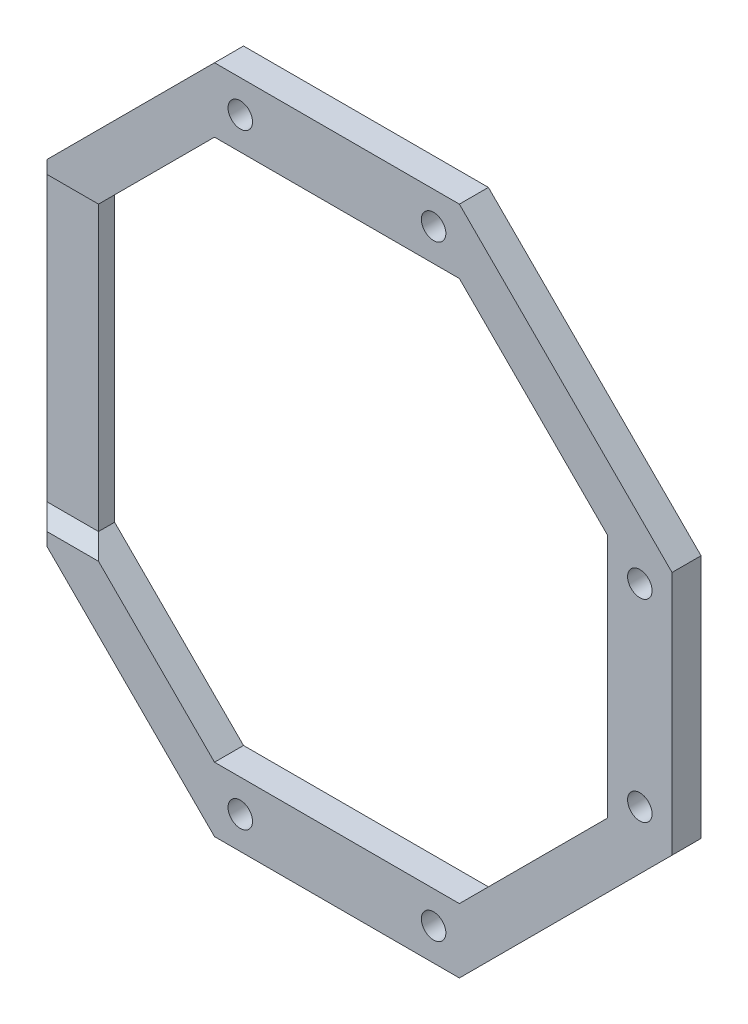
ISO-10303-21;
HEADER;
FILE_DESCRIPTION(('STEP AP214'),'2;1');
FILE_NAME('part.step','',(''),(''),'','','');
FILE_SCHEMA(('AUTOMOTIVE_DESIGN { 1 0 10303 214 1 1 1 1 }'));
ENDSEC;
DATA;
#1=APPLICATION_CONTEXT('core data for automotive mechanical design processes');
#2=APPLICATION_PROTOCOL_DEFINITION('international standard','automotive_design',2000,#1);
#3=PRODUCT_CONTEXT('',#1,'mechanical');
#4=PRODUCT('Part','Part','',(#3));
#5=PRODUCT_RELATED_PRODUCT_CATEGORY('part','',(#4));
#6=PRODUCT_DEFINITION_FORMATION('','',#4);
#7=PRODUCT_DEFINITION_CONTEXT('part definition',#1,'design');
#8=PRODUCT_DEFINITION('design','',#6,#7);
#9=PRODUCT_DEFINITION_SHAPE('','',#8);
#10=(LENGTH_UNIT() NAMED_UNIT(*) SI_UNIT(.MILLI.,.METRE.));
#11=(NAMED_UNIT(*) PLANE_ANGLE_UNIT() SI_UNIT($,.RADIAN.));
#12=(NAMED_UNIT(*) SI_UNIT($,.STERADIAN.) SOLID_ANGLE_UNIT());
#13=UNCERTAINTY_MEASURE_WITH_UNIT(LENGTH_MEASURE(1.E-05),#10,'distance_accuracy_value','');
#14=(GEOMETRIC_REPRESENTATION_CONTEXT(3) GLOBAL_UNCERTAINTY_ASSIGNED_CONTEXT((#13)) GLOBAL_UNIT_ASSIGNED_CONTEXT((#10,
#11,#12)) REPRESENTATION_CONTEXT('',''));
#15=CARTESIAN_POINT('',(0.,0.,0.));
#16=DIRECTION('',(0.,0.,1.));
#17=DIRECTION('',(1.,0.,0.));
#18=AXIS2_PLACEMENT_3D('',#15,#16,#17);
#19=CARTESIAN_POINT('',(64.488658439,-84.505114056,-63.2));
#20=DIRECTION('',(-0.707106781186548,-0.707106781186548,0.));
#21=DIRECTION('',(-0.707106781186548,0.707106781186548,0.));
#22=AXIS2_PLACEMENT_3D('',#19,#20,#21);
#23=PLANE('',#22);
#24=DIRECTION('',(-0.707106781186548,0.707106781186548,0.));
#25=VECTOR('',#24,1.);
#26=CARTESIAN_POINT('',(80.988658439,-101.005114056,-63.2));
#27=LINE('',#26,#25);
#28=CARTESIAN_POINT('',(80.988658439,-101.005114056,-63.2));
#29=VERTEX_POINT('',#28);
#30=CARTESIAN_POINT('',(54.988658439,-75.005114056,-63.2));
#31=VERTEX_POINT('',#30);
#32=EDGE_CURVE('E11',#29,#31,#27,.T.);
#33=ORIENTED_EDGE('',*,*,#32,.T.);
#34=DIRECTION('',(-0.577350269189626,0.577350269189626,-0.577350269189626));
#35=VECTOR('',#34,1.);
#36=CARTESIAN_POINT('',(54.988658439,-75.005114056,-63.2));
#37=LINE('',#36,#35);
#38=CARTESIAN_POINT('',(50.488658439,-70.505114056,-67.7));
#39=VERTEX_POINT('',#38);
#40=EDGE_CURVE('E47',#31,#39,#37,.T.);
#41=ORIENTED_EDGE('',*,*,#40,.T.);
#42=DIRECTION('',(-0.707106781186548,0.707106781186548,0.));
#43=VECTOR('',#42,1.);
#44=CARTESIAN_POINT('',(80.988658439,-101.005114056,-67.7));
#45=LINE('',#44,#43);
#46=CARTESIAN_POINT('',(80.988658439,-101.005114056,-67.7));
#47=VERTEX_POINT('',#46);
#48=EDGE_CURVE('E62',#47,#39,#45,.T.);
#49=ORIENTED_EDGE('',*,*,#48,.F.);
#50=DIRECTION('',(0.,0.,-1.));
#51=VECTOR('',#50,1.);
#52=CARTESIAN_POINT('',(80.988658439,-101.005114056,-63.2));
#53=LINE('',#52,#51);
#54=EDGE_CURVE('E303',#29,#47,#53,.T.);
#55=ORIENTED_EDGE('',*,*,#54,.F.);
#56=EDGE_LOOP('',(#33,#41,#49,#55));
#57=FACE_BOUND('',#56,.T.);
#58=ADVANCED_FACE('F38',(#57),#23,.T.);
#59=CARTESIAN_POINT('',(90.488658439,-101.005114056,-63.2));
#60=DIRECTION('',(0.,1.,0.));
#61=DIRECTION('',(1.,0.,0.));
#62=AXIS2_PLACEMENT_3D('',#59,#60,#61);
#63=PLANE('',#62);
#64=DIRECTION('',(1.,0.,0.));
#65=VECTOR('',#64,1.);
#66=CARTESIAN_POINT('',(80.988658439,-101.005114056,-67.7));
#67=LINE('',#66,#65);
#68=CARTESIAN_POINT('',(118.988658439,-101.005114056,-67.7));
#69=VERTEX_POINT('',#68);
#70=EDGE_CURVE('E408',#47,#69,#67,.T.);
#71=ORIENTED_EDGE('',*,*,#70,.T.);
#72=DIRECTION('',(0.,0.,-1.));
#73=VECTOR('',#72,1.);
#74=CARTESIAN_POINT('',(118.988658439,-101.005114056,-63.2));
#75=LINE('',#74,#73);
#76=CARTESIAN_POINT('',(118.988658439,-101.005114056,-63.2));
#77=VERTEX_POINT('',#76);
#78=EDGE_CURVE('E281',#77,#69,#75,.T.);
#79=ORIENTED_EDGE('',*,*,#78,.F.);
#80=DIRECTION('',(1.,0.,0.));
#81=VECTOR('',#80,1.);
#82=CARTESIAN_POINT('',(80.988658439,-101.005114056,-63.2));
#83=LINE('',#82,#81);
#84=EDGE_CURVE('E398',#29,#77,#83,.T.);
#85=ORIENTED_EDGE('',*,*,#84,.F.);
#86=ORIENTED_EDGE('',*,*,#54,.T.);
#87=EDGE_LOOP('',(#71,#79,#85,#86));
#88=FACE_BOUND('',#87,.T.);
#89=ADVANCED_FACE('F524',(#88),#63,.F.);
#90=CARTESIAN_POINT('',(135.488658439,-84.505114056,-63.2));
#91=DIRECTION('',(-0.707106781186548,0.707106781186548,0.));
#92=DIRECTION('',(0.,0.,1.));
#93=AXIS2_PLACEMENT_3D('',#90,#91,#92);
#94=PLANE('',#93);
#95=DIRECTION('',(0.707106781186548,0.707106781186548,0.));
#96=VECTOR('',#95,1.);
#97=CARTESIAN_POINT('',(118.988658439,-101.005114056,-67.7));
#98=LINE('',#97,#96);
#99=CARTESIAN_POINT('',(151.988658439,-68.005114056,-67.7));
#100=VERTEX_POINT('',#99);
#101=EDGE_CURVE('E283',#69,#100,#98,.T.);
#102=ORIENTED_EDGE('',*,*,#101,.T.);
#103=DIRECTION('',(0.,0.,-1.));
#104=VECTOR('',#103,1.);
#105=CARTESIAN_POINT('',(151.988658439,-68.005114056,-63.2));
#106=LINE('',#105,#104);
#107=CARTESIAN_POINT('',(151.988658439,-68.005114056,-63.2));
#108=VERTEX_POINT('',#107);
#109=EDGE_CURVE('E318',#108,#100,#106,.T.);
#110=ORIENTED_EDGE('',*,*,#109,.F.);
#111=DIRECTION('',(0.707106781186548,0.707106781186548,0.));
#112=VECTOR('',#111,1.);
#113=CARTESIAN_POINT('',(118.988658439,-101.005114056,-63.2));
#114=LINE('',#113,#112);
#115=EDGE_CURVE('E400',#77,#108,#114,.T.);
#116=ORIENTED_EDGE('',*,*,#115,.F.);
#117=ORIENTED_EDGE('',*,*,#78,.T.);
#118=EDGE_LOOP('',(#102,#110,#116,#117));
#119=FACE_BOUND('',#118,.T.);
#120=ADVANCED_FACE('F530',(#119),#94,.F.);
#121=CARTESIAN_POINT('',(151.988658439,-49.005114056,-63.2));
#122=DIRECTION('',(1.,0.,0.));
#123=DIRECTION('',(0.,1.,0.));
#124=AXIS2_PLACEMENT_3D('',#121,#122,#123);
#125=PLANE('',#124);
#126=DIRECTION('',(0.,-1.,0.));
#127=VECTOR('',#126,1.);
#128=CARTESIAN_POINT('',(151.988658439,-30.005114056,-67.7));
#129=LINE('',#128,#127);
#130=CARTESIAN_POINT('',(151.988658439,-30.005114056,-67.7));
#131=VERTEX_POINT('',#130);
#132=EDGE_CURVE('E299',#131,#100,#129,.T.);
#133=ORIENTED_EDGE('',*,*,#132,.F.);
#134=DIRECTION('',(0.,0.,-1.));
#135=VECTOR('',#134,1.);
#136=CARTESIAN_POINT('',(151.988658439,-30.005114056,-63.2));
#137=LINE('',#136,#135);
#138=CARTESIAN_POINT('',(151.988658439,-30.005114056,-63.2));
#139=VERTEX_POINT('',#138);
#140=EDGE_CURVE('E411',#139,#131,#137,.T.);
#141=ORIENTED_EDGE('',*,*,#140,.F.);
#142=DIRECTION('',(0.,-1.,0.));
#143=VECTOR('',#142,1.);
#144=CARTESIAN_POINT('',(151.988658439,-30.005114056,-63.2));
#145=LINE('',#144,#143);
#146=EDGE_CURVE('E284',#139,#108,#145,.T.);
#147=ORIENTED_EDGE('',*,*,#146,.T.);
#148=ORIENTED_EDGE('',*,*,#109,.T.);
#149=EDGE_LOOP('',(#133,#141,#147,#148));
#150=FACE_BOUND('',#149,.T.);
#151=ADVANCED_FACE('F40',(#150),#125,.T.);
#152=CARTESIAN_POINT('',(135.488658439,-13.505114056,-63.2));
#153=DIRECTION('',(-0.707106781186548,-0.707106781186548,0.));
#154=DIRECTION('',(-0.707106781186548,0.707106781186548,0.));
#155=AXIS2_PLACEMENT_3D('',#152,#153,#154);
#156=PLANE('',#155);
#157=DIRECTION('',(-0.707106781186548,0.707106781186548,0.));
#158=VECTOR('',#157,1.);
#159=CARTESIAN_POINT('',(151.988658439,-30.005114056,-67.7));
#160=LINE('',#159,#158);
#161=CARTESIAN_POINT('',(118.988658439,2.994885944,-67.7));
#162=VERTEX_POINT('',#161);
#163=EDGE_CURVE('E320',#131,#162,#160,.T.);
#164=ORIENTED_EDGE('',*,*,#163,.T.);
#165=DIRECTION('',(0.,0.,-1.));
#166=VECTOR('',#165,1.);
#167=CARTESIAN_POINT('',(118.988658439,2.994885944,-63.2));
#168=LINE('',#167,#166);
#169=CARTESIAN_POINT('',(118.988658439,2.994885944,-63.2));
#170=VERTEX_POINT('',#169);
#171=EDGE_CURVE('E177',#170,#162,#168,.T.);
#172=ORIENTED_EDGE('',*,*,#171,.F.);
#173=DIRECTION('',(-0.707106781186548,0.707106781186548,0.));
#174=VECTOR('',#173,1.);
#175=CARTESIAN_POINT('',(151.988658439,-30.005114056,-63.2));
#176=LINE('',#175,#174);
#177=EDGE_CURVE('E170',#139,#170,#176,.T.);
#178=ORIENTED_EDGE('',*,*,#177,.F.);
#179=ORIENTED_EDGE('',*,*,#140,.T.);
#180=EDGE_LOOP('',(#164,#172,#178,#179));
#181=FACE_BOUND('',#180,.T.);
#182=ADVANCED_FACE('F533',(#181),#156,.F.);
#183=CARTESIAN_POINT('',(109.488658439,2.994885944,-63.2));
#184=DIRECTION('',(0.,-1.,0.));
#185=DIRECTION('',(0.,0.,-1.));
#186=AXIS2_PLACEMENT_3D('',#183,#184,#185);
#187=PLANE('',#186);
#188=DIRECTION('',(-1.,0.,0.));
#189=VECTOR('',#188,1.);
#190=CARTESIAN_POINT('',(118.988658439,2.994885944,-67.7));
#191=LINE('',#190,#189);
#192=CARTESIAN_POINT('',(80.988658439,2.994885944,-67.7));
#193=VERTEX_POINT('',#192);
#194=EDGE_CURVE('E414',#162,#193,#191,.T.);
#195=ORIENTED_EDGE('',*,*,#194,.T.);
#196=DIRECTION('',(0.,0.,-1.));
#197=VECTOR('',#196,1.);
#198=CARTESIAN_POINT('',(80.988658439,2.994885944,-63.2));
#199=LINE('',#198,#197);
#200=CARTESIAN_POINT('',(80.988658439,2.994885944,-63.2));
#201=VERTEX_POINT('',#200);
#202=EDGE_CURVE('E314',#201,#193,#199,.T.);
#203=ORIENTED_EDGE('',*,*,#202,.F.);
#204=DIRECTION('',(-1.,0.,0.));
#205=VECTOR('',#204,1.);
#206=CARTESIAN_POINT('',(118.988658439,2.994885944,-63.2));
#207=LINE('',#206,#205);
#208=EDGE_CURVE('E345',#170,#201,#207,.T.);
#209=ORIENTED_EDGE('',*,*,#208,.F.);
#210=ORIENTED_EDGE('',*,*,#171,.T.);
#211=EDGE_LOOP('',(#195,#203,#209,#210));
#212=FACE_BOUND('',#211,.T.);
#213=ADVANCED_FACE('F553',(#212),#187,.F.);
#214=CARTESIAN_POINT('',(64.488658439,-13.505114056,-63.2));
#215=DIRECTION('',(-0.707106781186548,0.707106781186548,0.));
#216=DIRECTION('',(0.,0.,1.));
#217=AXIS2_PLACEMENT_3D('',#214,#215,#216);
#218=PLANE('',#217);
#219=DIRECTION('',(0.707106781186548,0.707106781186548,0.));
#220=VECTOR('',#219,1.);
#221=CARTESIAN_POINT('',(50.488658439,-27.505114056,-67.7));
#222=LINE('',#221,#220);
#223=CARTESIAN_POINT('',(50.488658439,-27.505114056,-67.7));
#224=VERTEX_POINT('',#223);
#225=EDGE_CURVE('E359',#224,#193,#222,.T.);
#226=ORIENTED_EDGE('',*,*,#225,.F.);
#227=DIRECTION('',(0.577350269189626,0.577350269189626,0.577350269189626));
#228=VECTOR('',#227,1.);
#229=CARTESIAN_POINT('',(50.488658439,-27.505114056,-67.7));
#230=LINE('',#229,#228);
#231=CARTESIAN_POINT('',(54.988658439,-23.005114056,-63.2));
#232=VERTEX_POINT('',#231);
#233=EDGE_CURVE('E277',#224,#232,#230,.T.);
#234=ORIENTED_EDGE('',*,*,#233,.T.);
#235=DIRECTION('',(0.707106781186548,0.707106781186548,0.));
#236=VECTOR('',#235,1.);
#237=CARTESIAN_POINT('',(54.988658439,-23.005114056,-63.2));
#238=LINE('',#237,#236);
#239=EDGE_CURVE('E280',#232,#201,#238,.T.);
#240=ORIENTED_EDGE('',*,*,#239,.T.);
#241=ORIENTED_EDGE('',*,*,#202,.T.);
#242=EDGE_LOOP('',(#226,#234,#240,#241));
#243=FACE_BOUND('',#242,.T.);
#244=ADVANCED_FACE('F549',(#243),#218,.T.);
#245=CARTESIAN_POINT('',(70.988658439,-17.005114056,-63.2));
#246=DIRECTION('',(0.707106781186548,-0.707106781186548,0.));
#247=DIRECTION('',(0.,0.,-1.));
#248=AXIS2_PLACEMENT_3D('',#245,#246,#247);
#249=PLANE('',#248);
#250=DIRECTION('',(-0.707106781186548,-0.707106781186548,0.));
#251=VECTOR('',#250,1.);
#252=CARTESIAN_POINT('',(80.988658439,-7.005114056,-63.2));
#253=LINE('',#252,#251);
#254=CARTESIAN_POINT('',(80.988658439,-7.005114056,-63.2));
#255=VERTEX_POINT('',#254);
#256=CARTESIAN_POINT('',(62.988658439,-25.005114056,-63.2));
#257=VERTEX_POINT('',#256);
#258=EDGE_CURVE('E478',#255,#257,#253,.T.);
#259=ORIENTED_EDGE('',*,*,#258,.T.);
#260=DIRECTION('',(-0.577350269189626,-0.577350269189626,-0.577350269189626));
#261=VECTOR('',#260,1.);
#262=CARTESIAN_POINT('',(62.988658439,-25.005114056,-63.2));
#263=LINE('',#262,#261);
#264=CARTESIAN_POINT('',(60.988658439,-27.005114056,-65.2));
#265=VERTEX_POINT('',#264);
#266=EDGE_CURVE('E324',#257,#265,#263,.T.);
#267=ORIENTED_EDGE('',*,*,#266,.T.);
#268=DIRECTION('',(0.,0.,-1.));
#269=VECTOR('',#268,1.);
#270=CARTESIAN_POINT('',(60.988658439,-27.005114056,-65.2));
#271=LINE('',#270,#269);
#272=CARTESIAN_POINT('',(60.988658439,-27.005114056,-67.7));
#273=VERTEX_POINT('',#272);
#274=EDGE_CURVE('E321',#265,#273,#271,.T.);
#275=ORIENTED_EDGE('',*,*,#274,.T.);
#276=DIRECTION('',(-0.707106781186548,-0.707106781186548,0.));
#277=VECTOR('',#276,1.);
#278=CARTESIAN_POINT('',(80.988658439,-7.005114056,-67.7));
#279=LINE('',#278,#277);
#280=CARTESIAN_POINT('',(80.988658439,-7.005114056,-67.7));
#281=VERTEX_POINT('',#280);
#282=EDGE_CURVE('E300',#281,#273,#279,.T.);
#283=ORIENTED_EDGE('',*,*,#282,.F.);
#284=DIRECTION('',(0.,0.,-1.));
#285=VECTOR('',#284,1.);
#286=CARTESIAN_POINT('',(80.988658439,-7.005114056,-63.2));
#287=LINE('',#286,#285);
#288=EDGE_CURVE('E388',#255,#281,#287,.T.);
#289=ORIENTED_EDGE('',*,*,#288,.F.);
#290=EDGE_LOOP('',(#259,#267,#275,#283,#289));
#291=FACE_BOUND('',#290,.T.);
#292=ADVANCED_FACE('F552',(#291),#249,.T.);
#293=CARTESIAN_POINT('',(99.988658439,-7.005114056,-63.2));
#294=DIRECTION('',(0.,1.,0.));
#295=DIRECTION('',(1.,0.,0.));
#296=AXIS2_PLACEMENT_3D('',#293,#294,#295);
#297=PLANE('',#296);
#298=DIRECTION('',(1.,0.,0.));
#299=VECTOR('',#298,1.);
#300=CARTESIAN_POINT('',(80.988658439,-7.005114056,-67.7));
#301=LINE('',#300,#299);
#302=CARTESIAN_POINT('',(118.988658439,-7.005114056,-67.7));
#303=VERTEX_POINT('',#302);
#304=EDGE_CURVE('E325',#281,#303,#301,.T.);
#305=ORIENTED_EDGE('',*,*,#304,.T.);
#306=DIRECTION('',(0.,0.,-1.));
#307=VECTOR('',#306,1.);
#308=CARTESIAN_POINT('',(118.988658439,-7.005114056,-63.2));
#309=LINE('',#308,#307);
#310=CARTESIAN_POINT('',(118.988658439,-7.005114056,-63.2));
#311=VERTEX_POINT('',#310);
#312=EDGE_CURVE('E307',#311,#303,#309,.T.);
#313=ORIENTED_EDGE('',*,*,#312,.F.);
#314=DIRECTION('',(1.,0.,0.));
#315=VECTOR('',#314,1.);
#316=CARTESIAN_POINT('',(80.988658439,-7.005114056,-63.2));
#317=LINE('',#316,#315);
#318=EDGE_CURVE('E331',#255,#311,#317,.T.);
#319=ORIENTED_EDGE('',*,*,#318,.F.);
#320=ORIENTED_EDGE('',*,*,#288,.T.);
#321=EDGE_LOOP('',(#305,#313,#319,#320));
#322=FACE_BOUND('',#321,.T.);
#323=ADVANCED_FACE('F574',(#322),#297,.F.);
#324=CARTESIAN_POINT('',(130.488658439,-18.505114056,-63.2));
#325=DIRECTION('',(0.707106781186548,0.707106781186548,0.));
#326=DIRECTION('',(0.,0.,-1.));
#327=AXIS2_PLACEMENT_3D('',#324,#325,#326);
#328=PLANE('',#327);
#329=DIRECTION('',(0.707106781186548,-0.707106781186548,0.));
#330=VECTOR('',#329,1.);
#331=CARTESIAN_POINT('',(118.988658439,-7.005114056,-67.7));
#332=LINE('',#331,#330);
#333=CARTESIAN_POINT('',(141.988658439,-30.005114056,-67.7));
#334=VERTEX_POINT('',#333);
#335=EDGE_CURVE('E382',#303,#334,#332,.T.);
#336=ORIENTED_EDGE('',*,*,#335,.T.);
#337=DIRECTION('',(0.,0.,-1.));
#338=VECTOR('',#337,1.);
#339=CARTESIAN_POINT('',(141.988658439,-30.005114056,-63.2));
#340=LINE('',#339,#338);
#341=CARTESIAN_POINT('',(141.988658439,-30.005114056,-63.2));
#342=VERTEX_POINT('',#341);
#343=EDGE_CURVE('E308',#342,#334,#340,.T.);
#344=ORIENTED_EDGE('',*,*,#343,.F.);
#345=DIRECTION('',(0.707106781186548,-0.707106781186548,0.));
#346=VECTOR('',#345,1.);
#347=CARTESIAN_POINT('',(118.988658439,-7.005114056,-63.2));
#348=LINE('',#347,#346);
#349=EDGE_CURVE('E329',#311,#342,#348,.T.);
#350=ORIENTED_EDGE('',*,*,#349,.F.);
#351=ORIENTED_EDGE('',*,*,#312,.T.);
#352=EDGE_LOOP('',(#336,#344,#350,#351));
#353=FACE_BOUND('',#352,.T.);
#354=ADVANCED_FACE('F569',(#353),#328,.F.);
#355=CARTESIAN_POINT('',(141.988658439,-49.005114056,-63.2));
#356=DIRECTION('',(1.,0.,0.));
#357=DIRECTION('',(0.,1.,0.));
#358=AXIS2_PLACEMENT_3D('',#355,#356,#357);
#359=PLANE('',#358);
#360=DIRECTION('',(0.,-1.,0.));
#361=VECTOR('',#360,1.);
#362=CARTESIAN_POINT('',(141.988658439,-30.005114056,-67.7));
#363=LINE('',#362,#361);
#364=CARTESIAN_POINT('',(141.988658439,-68.005114056,-67.7));
#365=VERTEX_POINT('',#364);
#366=EDGE_CURVE('E304',#334,#365,#363,.T.);
#367=ORIENTED_EDGE('',*,*,#366,.T.);
#368=DIRECTION('',(0.,0.,-1.));
#369=VECTOR('',#368,1.);
#370=CARTESIAN_POINT('',(141.988658439,-68.005114056,-63.2));
#371=LINE('',#370,#369);
#372=CARTESIAN_POINT('',(141.988658439,-68.005114056,-63.2));
#373=VERTEX_POINT('',#372);
#374=EDGE_CURVE('E285',#373,#365,#371,.T.);
#375=ORIENTED_EDGE('',*,*,#374,.F.);
#376=DIRECTION('',(0.,-1.,0.));
#377=VECTOR('',#376,1.);
#378=CARTESIAN_POINT('',(141.988658439,-30.005114056,-63.2));
#379=LINE('',#378,#377);
#380=EDGE_CURVE('E332',#342,#373,#379,.T.);
#381=ORIENTED_EDGE('',*,*,#380,.F.);
#382=ORIENTED_EDGE('',*,*,#343,.T.);
#383=EDGE_LOOP('',(#367,#375,#381,#382));
#384=FACE_BOUND('',#383,.T.);
#385=ADVANCED_FACE('F543',(#384),#359,.F.);
#386=CARTESIAN_POINT('',(130.488658439,-79.505114056,-63.2));
#387=DIRECTION('',(-0.707106781186548,0.707106781186548,0.));
#388=DIRECTION('',(0.,0.,1.));
#389=AXIS2_PLACEMENT_3D('',#386,#387,#388);
#390=PLANE('',#389);
#391=DIRECTION('',(0.707106781186548,0.707106781186548,0.));
#392=VECTOR('',#391,1.);
#393=CARTESIAN_POINT('',(118.988658439,-91.005114056,-67.7));
#394=LINE('',#393,#392);
#395=CARTESIAN_POINT('',(118.988658439,-91.005114056,-67.7));
#396=VERTEX_POINT('',#395);
#397=EDGE_CURVE('E374',#396,#365,#394,.T.);
#398=ORIENTED_EDGE('',*,*,#397,.F.);
#399=DIRECTION('',(0.,0.,-1.));
#400=VECTOR('',#399,1.);
#401=CARTESIAN_POINT('',(118.988658439,-91.005114056,-63.2));
#402=LINE('',#401,#400);
#403=CARTESIAN_POINT('',(118.988658439,-91.005114056,-63.2));
#404=VERTEX_POINT('',#403);
#405=EDGE_CURVE('E311',#404,#396,#402,.T.);
#406=ORIENTED_EDGE('',*,*,#405,.F.);
#407=DIRECTION('',(0.707106781186548,0.707106781186548,0.));
#408=VECTOR('',#407,1.);
#409=CARTESIAN_POINT('',(118.988658439,-91.005114056,-63.2));
#410=LINE('',#409,#408);
#411=EDGE_CURVE('E287',#404,#373,#410,.T.);
#412=ORIENTED_EDGE('',*,*,#411,.T.);
#413=ORIENTED_EDGE('',*,*,#374,.T.);
#414=EDGE_LOOP('',(#398,#406,#412,#413));
#415=FACE_BOUND('',#414,.T.);
#416=ADVANCED_FACE('F539',(#415),#390,.T.);
#417=CARTESIAN_POINT('',(99.988658439,-91.005114056,-63.2));
#418=DIRECTION('',(0.,-1.,0.));
#419=DIRECTION('',(0.,0.,-1.));
#420=AXIS2_PLACEMENT_3D('',#417,#418,#419);
#421=PLANE('',#420);
#422=DIRECTION('',(-1.,0.,0.));
#423=VECTOR('',#422,1.);
#424=CARTESIAN_POINT('',(118.988658439,-91.005114056,-67.7));
#425=LINE('',#424,#423);
#426=CARTESIAN_POINT('',(80.988658439,-91.005114056,-67.7));
#427=VERTEX_POINT('',#426);
#428=EDGE_CURVE('E288',#396,#427,#425,.T.);
#429=ORIENTED_EDGE('',*,*,#428,.T.);
#430=DIRECTION('',(0.,0.,-1.));
#431=VECTOR('',#430,1.);
#432=CARTESIAN_POINT('',(80.988658439,-91.005114056,-63.2));
#433=LINE('',#432,#431);
#434=CARTESIAN_POINT('',(80.988658439,-91.005114056,-63.2));
#435=VERTEX_POINT('',#434);
#436=EDGE_CURVE('E419',#435,#427,#433,.T.);
#437=ORIENTED_EDGE('',*,*,#436,.F.);
#438=DIRECTION('',(-1.,0.,0.));
#439=VECTOR('',#438,1.);
#440=CARTESIAN_POINT('',(118.988658439,-91.005114056,-63.2));
#441=LINE('',#440,#439);
#442=EDGE_CURVE('E342',#404,#435,#441,.T.);
#443=ORIENTED_EDGE('',*,*,#442,.F.);
#444=ORIENTED_EDGE('',*,*,#405,.T.);
#445=EDGE_LOOP('',(#429,#437,#443,#444));
#446=FACE_BOUND('',#445,.T.);
#447=ADVANCED_FACE('F542',(#446),#421,.F.);
#448=CARTESIAN_POINT('',(70.988658439,-81.005114056,-63.2));
#449=DIRECTION('',(-0.707106781186548,-0.707106781186548,0.));
#450=DIRECTION('',(-0.707106781186548,0.707106781186548,0.));
#451=AXIS2_PLACEMENT_3D('',#448,#449,#450);
#452=PLANE('',#451);
#453=DIRECTION('',(0.,0.,-1.));
#454=VECTOR('',#453,1.);
#455=CARTESIAN_POINT('',(60.988658439,-71.005114056,-65.2));
#456=LINE('',#455,#454);
#457=CARTESIAN_POINT('',(60.988658439,-71.005114056,-65.2));
#458=VERTEX_POINT('',#457);
#459=CARTESIAN_POINT('',(60.988658439,-71.005114056,-67.7));
#460=VERTEX_POINT('',#459);
#461=EDGE_CURVE('E459',#458,#460,#456,.T.);
#462=ORIENTED_EDGE('',*,*,#461,.F.);
#463=DIRECTION('',(0.577350269189626,-0.577350269189626,0.577350269189626));
#464=VECTOR('',#463,1.);
#465=CARTESIAN_POINT('',(60.988658439,-71.005114056,-65.2));
#466=LINE('',#465,#464);
#467=CARTESIAN_POINT('',(62.988658439,-73.005114056,-63.2));
#468=VERTEX_POINT('',#467);
#469=EDGE_CURVE('E328',#458,#468,#466,.T.);
#470=ORIENTED_EDGE('',*,*,#469,.T.);
#471=DIRECTION('',(-0.707106781186548,0.707106781186548,0.));
#472=VECTOR('',#471,1.);
#473=CARTESIAN_POINT('',(80.988658439,-91.005114056,-63.2));
#474=LINE('',#473,#472);
#475=EDGE_CURVE('E275',#435,#468,#474,.T.);
#476=ORIENTED_EDGE('',*,*,#475,.F.);
#477=ORIENTED_EDGE('',*,*,#436,.T.);
#478=DIRECTION('',(-0.707106781186548,0.707106781186548,0.));
#479=VECTOR('',#478,1.);
#480=CARTESIAN_POINT('',(80.988658439,-91.005114056,-67.7));
#481=LINE('',#480,#479);
#482=EDGE_CURVE('E416',#427,#460,#481,.T.);
#483=ORIENTED_EDGE('',*,*,#482,.T.);
#484=EDGE_LOOP('',(#462,#470,#476,#477,#483));
#485=FACE_BOUND('',#484,.T.);
#486=ADVANCED_FACE('F546',(#485),#452,.F.);
#487=CARTESIAN_POINT('',(114.988658439,-2.005114056,-63.2));
#488=DIRECTION('',(0.,0.,-1.));
#489=DIRECTION('',(-1.,0.,0.));
#490=AXIS2_PLACEMENT_3D('',#487,#488,#489);
#491=CYLINDRICAL_SURFACE('',#490,1.9);
#492=DIRECTION('',(0.,0.,1.));
#493=VECTOR('',#492,1.);
#494=CARTESIAN_POINT('',(113.088658439,-2.005114056,-67.7));
#495=LINE('',#494,#493);
#496=CARTESIAN_POINT('',(113.088658439,-2.005114056,-67.7));
#497=VERTEX_POINT('',#496);
#498=CARTESIAN_POINT('',(113.088658439,-2.005114056,-63.2));
#499=VERTEX_POINT('',#498);
#500=EDGE_CURVE('E335',#497,#499,#495,.T.);
#501=ORIENTED_EDGE('',*,*,#500,.F.);
#502=CARTESIAN_POINT('',(114.988658439,-2.005114056,-67.7));
#503=DIRECTION('',(0.,0.,-1.));
#504=DIRECTION('',(1.,0.,0.));
#505=AXIS2_PLACEMENT_3D('',#502,#503,#504);
#506=CIRCLE('',#505,1.9);
#507=CARTESIAN_POINT('',(116.888658439,-2.005114056,-67.7));
#508=VERTEX_POINT('',#507);
#509=EDGE_CURVE('E420',#497,#508,#506,.T.);
#510=ORIENTED_EDGE('',*,*,#509,.T.);
#511=CARTESIAN_POINT('',(114.988658439,-2.005114056,-67.7));
#512=DIRECTION('',(0.,0.,-1.));
#513=DIRECTION('',(1.,0.,0.));
#514=AXIS2_PLACEMENT_3D('',#511,#512,#513);
#515=CIRCLE('',#514,1.9);
#516=EDGE_CURVE('E271',#508,#497,#515,.T.);
#517=ORIENTED_EDGE('',*,*,#516,.T.);
#518=ORIENTED_EDGE('',*,*,#500,.T.);
#519=CARTESIAN_POINT('',(114.988658439,-2.005114056,-63.2));
#520=DIRECTION('',(0.,0.,-1.));
#521=DIRECTION('',(1.,0.,0.));
#522=AXIS2_PLACEMENT_3D('',#519,#520,#521);
#523=CIRCLE('',#522,1.9);
#524=CARTESIAN_POINT('',(116.888658439,-2.005114056,-63.2));
#525=VERTEX_POINT('',#524);
#526=EDGE_CURVE('E423',#525,#499,#523,.T.);
#527=ORIENTED_EDGE('',*,*,#526,.F.);
#528=CARTESIAN_POINT('',(114.988658439,-2.005114056,-63.2));
#529=DIRECTION('',(0.,0.,-1.));
#530=DIRECTION('',(1.,0.,0.));
#531=AXIS2_PLACEMENT_3D('',#528,#529,#530);
#532=CIRCLE('',#531,1.9);
#533=EDGE_CURVE('E368',#499,#525,#532,.T.);
#534=ORIENTED_EDGE('',*,*,#533,.F.);
#535=EDGE_LOOP('',(#501,#510,#517,#518,#527,#534));
#536=FACE_BOUND('',#535,.T.);
#537=ADVANCED_FACE('F571',(#536),#491,.F.);
#538=CARTESIAN_POINT('',(146.988658439,-34.005114056,-63.2));
#539=DIRECTION('',(0.,0.,-1.));
#540=DIRECTION('',(-1.,0.,0.));
#541=AXIS2_PLACEMENT_3D('',#538,#539,#540);
#542=CYLINDRICAL_SURFACE('',#541,1.9);
#543=DIRECTION('',(0.,0.,1.));
#544=VECTOR('',#543,1.);
#545=CARTESIAN_POINT('',(145.088658439,-34.005114056,-67.7));
#546=LINE('',#545,#544);
#547=CARTESIAN_POINT('',(145.088658439,-34.005114056,-67.7));
#548=VERTEX_POINT('',#547);
#549=CARTESIAN_POINT('',(145.088658439,-34.005114056,-63.2));
#550=VERTEX_POINT('',#549);
#551=EDGE_CURVE('E347',#548,#550,#546,.T.);
#552=ORIENTED_EDGE('',*,*,#551,.F.);
#553=CARTESIAN_POINT('',(146.988658439,-34.005114056,-67.7));
#554=DIRECTION('',(0.,0.,-1.));
#555=DIRECTION('',(1.,0.,0.));
#556=AXIS2_PLACEMENT_3D('',#553,#554,#555);
#557=CIRCLE('',#556,1.9);
#558=CARTESIAN_POINT('',(148.888658439,-34.005114056,-67.7));
#559=VERTEX_POINT('',#558);
#560=EDGE_CURVE('E333',#548,#559,#557,.T.);
#561=ORIENTED_EDGE('',*,*,#560,.T.);
#562=CARTESIAN_POINT('',(146.988658439,-34.005114056,-67.7));
#563=DIRECTION('',(0.,0.,-1.));
#564=DIRECTION('',(1.,0.,0.));
#565=AXIS2_PLACEMENT_3D('',#562,#563,#564);
#566=CIRCLE('',#565,1.9);
#567=EDGE_CURVE('E336',#559,#548,#566,.T.);
#568=ORIENTED_EDGE('',*,*,#567,.T.);
#569=ORIENTED_EDGE('',*,*,#551,.T.);
#570=CARTESIAN_POINT('',(146.988658439,-34.005114056,-63.2));
#571=DIRECTION('',(0.,0.,-1.));
#572=DIRECTION('',(1.,0.,0.));
#573=AXIS2_PLACEMENT_3D('',#570,#571,#572);
#574=CIRCLE('',#573,1.9);
#575=CARTESIAN_POINT('',(148.888658439,-34.005114056,-63.2));
#576=VERTEX_POINT('',#575);
#577=EDGE_CURVE('E403',#576,#550,#574,.T.);
#578=ORIENTED_EDGE('',*,*,#577,.F.);
#579=CARTESIAN_POINT('',(146.988658439,-34.005114056,-63.2));
#580=DIRECTION('',(0.,0.,-1.));
#581=DIRECTION('',(1.,0.,0.));
#582=AXIS2_PLACEMENT_3D('',#579,#580,#581);
#583=CIRCLE('',#582,1.9);
#584=EDGE_CURVE('E405',#550,#576,#583,.T.);
#585=ORIENTED_EDGE('',*,*,#584,.F.);
#586=EDGE_LOOP('',(#552,#561,#568,#569,#578,#585));
#587=FACE_BOUND('',#586,.T.);
#588=ADVANCED_FACE('F537',(#587),#542,.F.);
#589=CARTESIAN_POINT('',(146.988658439,-64.005114056,-63.2));
#590=DIRECTION('',(0.,0.,-1.));
#591=DIRECTION('',(-1.,0.,0.));
#592=AXIS2_PLACEMENT_3D('',#589,#590,#591);
#593=CYLINDRICAL_SURFACE('',#592,1.9);
#594=DIRECTION('',(0.,0.,1.));
#595=VECTOR('',#594,1.);
#596=CARTESIAN_POINT('',(145.088658439,-64.005114056,-67.7));
#597=LINE('',#596,#595);
#598=CARTESIAN_POINT('',(145.088658439,-64.005114056,-67.7));
#599=VERTEX_POINT('',#598);
#600=CARTESIAN_POINT('',(145.088658439,-64.005114056,-63.2));
#601=VERTEX_POINT('',#600);
#602=EDGE_CURVE('E426',#599,#601,#597,.T.);
#603=ORIENTED_EDGE('',*,*,#602,.F.);
#604=CARTESIAN_POINT('',(146.988658439,-64.005114056,-67.7));
#605=DIRECTION('',(0.,0.,-1.));
#606=DIRECTION('',(1.,0.,0.));
#607=AXIS2_PLACEMENT_3D('',#604,#605,#606);
#608=CIRCLE('',#607,1.9);
#609=CARTESIAN_POINT('',(148.888658439,-64.005114056,-67.7));
#610=VERTEX_POINT('',#609);
#611=EDGE_CURVE('E351',#599,#610,#608,.T.);
#612=ORIENTED_EDGE('',*,*,#611,.T.);
#613=CARTESIAN_POINT('',(146.988658439,-64.005114056,-67.7));
#614=DIRECTION('',(0.,0.,-1.));
#615=DIRECTION('',(1.,0.,0.));
#616=AXIS2_PLACEMENT_3D('',#613,#614,#615);
#617=CIRCLE('',#616,1.9);
#618=EDGE_CURVE('E354',#610,#599,#617,.T.);
#619=ORIENTED_EDGE('',*,*,#618,.T.);
#620=ORIENTED_EDGE('',*,*,#602,.T.);
#621=CARTESIAN_POINT('',(146.988658439,-64.005114056,-63.2));
#622=DIRECTION('',(0.,0.,-1.));
#623=DIRECTION('',(1.,0.,0.));
#624=AXIS2_PLACEMENT_3D('',#621,#622,#623);
#625=CIRCLE('',#624,1.9);
#626=CARTESIAN_POINT('',(148.888658439,-64.005114056,-63.2));
#627=VERTEX_POINT('',#626);
#628=EDGE_CURVE('E427',#627,#601,#625,.T.);
#629=ORIENTED_EDGE('',*,*,#628,.F.);
#630=CARTESIAN_POINT('',(146.988658439,-64.005114056,-63.2));
#631=DIRECTION('',(0.,0.,-1.));
#632=DIRECTION('',(1.,0.,0.));
#633=AXIS2_PLACEMENT_3D('',#630,#631,#632);
#634=CIRCLE('',#633,1.9);
#635=EDGE_CURVE('E404',#601,#627,#634,.T.);
#636=ORIENTED_EDGE('',*,*,#635,.F.);
#637=EDGE_LOOP('',(#603,#612,#619,#620,#629,#636));
#638=FACE_BOUND('',#637,.T.);
#639=ADVANCED_FACE('F534',(#638),#593,.F.);
#640=CARTESIAN_POINT('',(114.988658439,-96.005114056,-63.2));
#641=DIRECTION('',(0.,0.,-1.));
#642=DIRECTION('',(-1.,0.,0.));
#643=AXIS2_PLACEMENT_3D('',#640,#641,#642);
#644=CYLINDRICAL_SURFACE('',#643,1.9);
#645=DIRECTION('',(0.,0.,1.));
#646=VECTOR('',#645,1.);
#647=CARTESIAN_POINT('',(113.088658439,-96.005114056,-67.7));
#648=LINE('',#647,#646);
#649=CARTESIAN_POINT('',(113.088658439,-96.005114056,-67.7));
#650=VERTEX_POINT('',#649);
#651=CARTESIAN_POINT('',(113.088658439,-96.005114056,-63.2));
#652=VERTEX_POINT('',#651);
#653=EDGE_CURVE('E262',#650,#652,#648,.T.);
#654=ORIENTED_EDGE('',*,*,#653,.F.);
#655=CARTESIAN_POINT('',(114.988658439,-96.005114056,-67.7));
#656=DIRECTION('',(0.,0.,-1.));
#657=DIRECTION('',(1.,0.,0.));
#658=AXIS2_PLACEMENT_3D('',#655,#656,#657);
#659=CIRCLE('',#658,1.9);
#660=CARTESIAN_POINT('',(116.888658439,-96.005114056,-67.7));
#661=VERTEX_POINT('',#660);
#662=EDGE_CURVE('E297',#650,#661,#659,.T.);
#663=ORIENTED_EDGE('',*,*,#662,.T.);
#664=CARTESIAN_POINT('',(114.988658439,-96.005114056,-67.7));
#665=DIRECTION('',(0.,0.,-1.));
#666=DIRECTION('',(1.,0.,0.));
#667=AXIS2_PLACEMENT_3D('',#664,#665,#666);
#668=CIRCLE('',#667,1.9);
#669=EDGE_CURVE('E294',#661,#650,#668,.T.);
#670=ORIENTED_EDGE('',*,*,#669,.T.);
#671=ORIENTED_EDGE('',*,*,#653,.T.);
#672=CARTESIAN_POINT('',(114.988658439,-96.005114056,-63.2));
#673=DIRECTION('',(0.,0.,-1.));
#674=DIRECTION('',(1.,0.,0.));
#675=AXIS2_PLACEMENT_3D('',#672,#673,#674);
#676=CIRCLE('',#675,1.9);
#677=CARTESIAN_POINT('',(116.888658439,-96.005114056,-63.2));
#678=VERTEX_POINT('',#677);
#679=EDGE_CURVE('E317',#678,#652,#676,.T.);
#680=ORIENTED_EDGE('',*,*,#679,.F.);
#681=CARTESIAN_POINT('',(114.988658439,-96.005114056,-63.2));
#682=DIRECTION('',(0.,0.,-1.));
#683=DIRECTION('',(1.,0.,0.));
#684=AXIS2_PLACEMENT_3D('',#681,#682,#683);
#685=CIRCLE('',#684,1.9);
#686=EDGE_CURVE('E42',#652,#678,#685,.T.);
#687=ORIENTED_EDGE('',*,*,#686,.F.);
#688=EDGE_LOOP('',(#654,#663,#670,#671,#680,#687));
#689=FACE_BOUND('',#688,.T.);
#690=ADVANCED_FACE('F490',(#689),#644,.F.);
#691=CARTESIAN_POINT('',(84.988658439,-96.005114056,-63.2));
#692=DIRECTION('',(0.,0.,-1.));
#693=DIRECTION('',(-1.,0.,0.));
#694=AXIS2_PLACEMENT_3D('',#691,#692,#693);
#695=CYLINDRICAL_SURFACE('',#694,1.9);
#696=DIRECTION('',(0.,0.,1.));
#697=VECTOR('',#696,1.);
#698=CARTESIAN_POINT('',(83.088658439,-96.005114056,-67.7));
#699=LINE('',#698,#697);
#700=CARTESIAN_POINT('',(83.088658439,-96.005114056,-67.7));
#701=VERTEX_POINT('',#700);
#702=CARTESIAN_POINT('',(83.088658439,-96.005114056,-63.2));
#703=VERTEX_POINT('',#702);
#704=EDGE_CURVE('E260',#701,#703,#699,.T.);
#705=ORIENTED_EDGE('',*,*,#704,.F.);
#706=CARTESIAN_POINT('',(84.988658439,-96.005114056,-67.7));
#707=DIRECTION('',(0.,0.,-1.));
#708=DIRECTION('',(1.,0.,0.));
#709=AXIS2_PLACEMENT_3D('',#706,#707,#708);
#710=CIRCLE('',#709,1.9);
#711=CARTESIAN_POINT('',(86.888658439,-96.005114056,-67.7));
#712=VERTEX_POINT('',#711);
#713=EDGE_CURVE('E255',#701,#712,#710,.T.);
#714=ORIENTED_EDGE('',*,*,#713,.T.);
#715=CARTESIAN_POINT('',(84.988658439,-96.005114056,-67.7));
#716=DIRECTION('',(0.,0.,-1.));
#717=DIRECTION('',(1.,0.,0.));
#718=AXIS2_PLACEMENT_3D('',#715,#716,#717);
#719=CIRCLE('',#718,1.9);
#720=EDGE_CURVE('E258',#712,#701,#719,.T.);
#721=ORIENTED_EDGE('',*,*,#720,.T.);
#722=ORIENTED_EDGE('',*,*,#704,.T.);
#723=CARTESIAN_POINT('',(84.988658439,-96.005114056,-63.2));
#724=DIRECTION('',(0.,0.,-1.));
#725=DIRECTION('',(1.,0.,0.));
#726=AXIS2_PLACEMENT_3D('',#723,#724,#725);
#727=CIRCLE('',#726,1.9);
#728=CARTESIAN_POINT('',(86.888658439,-96.005114056,-63.2));
#729=VERTEX_POINT('',#728);
#730=EDGE_CURVE('E249',#729,#703,#727,.T.);
#731=ORIENTED_EDGE('',*,*,#730,.F.);
#732=CARTESIAN_POINT('',(84.988658439,-96.005114056,-63.2));
#733=DIRECTION('',(0.,0.,-1.));
#734=DIRECTION('',(1.,0.,0.));
#735=AXIS2_PLACEMENT_3D('',#732,#733,#734);
#736=CIRCLE('',#735,1.9);
#737=EDGE_CURVE('E315',#703,#729,#736,.T.);
#738=ORIENTED_EDGE('',*,*,#737,.F.);
#739=EDGE_LOOP('',(#705,#714,#721,#722,#731,#738));
#740=FACE_BOUND('',#739,.T.);
#741=ADVANCED_FACE('F257',(#740),#695,.F.);
#742=CARTESIAN_POINT('',(84.988658439,-2.005114056,-63.2));
#743=DIRECTION('',(0.,0.,-1.));
#744=DIRECTION('',(-1.,0.,0.));
#745=AXIS2_PLACEMENT_3D('',#742,#743,#744);
#746=CYLINDRICAL_SURFACE('',#745,1.9);
#747=DIRECTION('',(0.,0.,1.));
#748=VECTOR('',#747,1.);
#749=CARTESIAN_POINT('',(83.088658439,-2.005114056,-67.7));
#750=LINE('',#749,#748);
#751=CARTESIAN_POINT('',(83.088658439,-2.005114056,-67.7));
#752=VERTEX_POINT('',#751);
#753=CARTESIAN_POINT('',(83.088658439,-2.005114056,-63.2));
#754=VERTEX_POINT('',#753);
#755=EDGE_CURVE('E372',#752,#754,#750,.T.);
#756=ORIENTED_EDGE('',*,*,#755,.F.);
#757=CARTESIAN_POINT('',(84.988658439,-2.005114056,-67.7));
#758=DIRECTION('',(0.,0.,-1.));
#759=DIRECTION('',(1.,0.,0.));
#760=AXIS2_PLACEMENT_3D('',#757,#758,#759);
#761=CIRCLE('',#760,1.9);
#762=CARTESIAN_POINT('',(86.888658439,-2.005114056,-67.7));
#763=VERTEX_POINT('',#762);
#764=EDGE_CURVE('E267',#752,#763,#761,.T.);
#765=ORIENTED_EDGE('',*,*,#764,.T.);
#766=CARTESIAN_POINT('',(84.988658439,-2.005114056,-67.7));
#767=DIRECTION('',(0.,0.,-1.));
#768=DIRECTION('',(1.,0.,0.));
#769=AXIS2_PLACEMENT_3D('',#766,#767,#768);
#770=CIRCLE('',#769,1.9);
#771=EDGE_CURVE('E366',#763,#752,#770,.T.);
#772=ORIENTED_EDGE('',*,*,#771,.T.);
#773=ORIENTED_EDGE('',*,*,#755,.T.);
#774=CARTESIAN_POINT('',(84.988658439,-2.005114056,-63.2));
#775=DIRECTION('',(0.,0.,-1.));
#776=DIRECTION('',(1.,0.,0.));
#777=AXIS2_PLACEMENT_3D('',#774,#775,#776);
#778=CIRCLE('',#777,1.9);
#779=CARTESIAN_POINT('',(86.888658439,-2.005114056,-63.2));
#780=VERTEX_POINT('',#779);
#781=EDGE_CURVE('E340',#780,#754,#778,.T.);
#782=ORIENTED_EDGE('',*,*,#781,.F.);
#783=CARTESIAN_POINT('',(84.988658439,-2.005114056,-63.2));
#784=DIRECTION('',(0.,0.,-1.));
#785=DIRECTION('',(1.,0.,0.));
#786=AXIS2_PLACEMENT_3D('',#783,#784,#785);
#787=CIRCLE('',#786,1.9);
#788=EDGE_CURVE('E337',#754,#780,#787,.T.);
#789=ORIENTED_EDGE('',*,*,#788,.F.);
#790=EDGE_LOOP('',(#756,#765,#772,#773,#782,#789));
#791=FACE_BOUND('',#790,.T.);
#792=ADVANCED_FACE('F506',(#791),#746,.F.);
#793=CARTESIAN_POINT('',(-96.011341561,-266.005114056,-63.2));
#794=DIRECTION('',(0.,0.,1.));
#795=DIRECTION('',(1.,0.,0.));
#796=AXIS2_PLACEMENT_3D('',#793,#794,#795);
#797=PLANE('',#796);
#798=ORIENTED_EDGE('',*,*,#239,.F.);
#799=DIRECTION('',(0.,-1.,0.));
#800=VECTOR('',#799,1.);
#801=CARTESIAN_POINT('',(54.988658439,-23.005114056,-63.2));
#802=LINE('',#801,#800);
#803=CARTESIAN_POINT('',(54.988658439,-25.005114056,-63.2));
#804=VERTEX_POINT('',#803);
#805=EDGE_CURVE('E369',#232,#804,#802,.T.);
#806=ORIENTED_EDGE('',*,*,#805,.T.);
#807=DIRECTION('',(1.,0.,0.));
#808=VECTOR('',#807,1.);
#809=CARTESIAN_POINT('',(54.988658439,-25.005114056,-63.2));
#810=LINE('',#809,#808);
#811=EDGE_CURVE('E373',#804,#257,#810,.T.);
#812=ORIENTED_EDGE('',*,*,#811,.T.);
#813=ORIENTED_EDGE('',*,*,#258,.F.);
#814=ORIENTED_EDGE('',*,*,#318,.T.);
#815=ORIENTED_EDGE('',*,*,#349,.T.);
#816=ORIENTED_EDGE('',*,*,#380,.T.);
#817=ORIENTED_EDGE('',*,*,#411,.F.);
#818=ORIENTED_EDGE('',*,*,#442,.T.);
#819=ORIENTED_EDGE('',*,*,#475,.T.);
#820=DIRECTION('',(-1.,0.,0.));
#821=VECTOR('',#820,1.);
#822=CARTESIAN_POINT('',(62.988658439,-73.005114056,-63.2));
#823=LINE('',#822,#821);
#824=CARTESIAN_POINT('',(54.988658439,-73.005114056,-63.2));
#825=VERTEX_POINT('',#824);
#826=EDGE_CURVE('E272',#468,#825,#823,.T.);
#827=ORIENTED_EDGE('',*,*,#826,.T.);
#828=DIRECTION('',(0.,-1.,0.));
#829=VECTOR('',#828,1.);
#830=CARTESIAN_POINT('',(54.988658439,-73.005114056,-63.2));
#831=LINE('',#830,#829);
#832=EDGE_CURVE('E276',#825,#31,#831,.T.);
#833=ORIENTED_EDGE('',*,*,#832,.T.);
#834=ORIENTED_EDGE('',*,*,#32,.F.);
#835=ORIENTED_EDGE('',*,*,#84,.T.);
#836=ORIENTED_EDGE('',*,*,#115,.T.);
#837=ORIENTED_EDGE('',*,*,#146,.F.);
#838=ORIENTED_EDGE('',*,*,#177,.T.);
#839=ORIENTED_EDGE('',*,*,#208,.T.);
#840=EDGE_LOOP('',(#798,#806,#812,#813,#814,#815,#816,#817,#818,#819,#827,#833,#834,#835,#836,
#837,#838,#839));
#841=FACE_BOUND('',#840,.T.);
#842=ORIENTED_EDGE('',*,*,#730,.T.);
#843=ORIENTED_EDGE('',*,*,#737,.T.);
#844=EDGE_LOOP('',(#842,#843));
#845=FACE_BOUND('',#844,.T.);
#846=ORIENTED_EDGE('',*,*,#679,.T.);
#847=ORIENTED_EDGE('',*,*,#686,.T.);
#848=EDGE_LOOP('',(#846,#847));
#849=FACE_BOUND('',#848,.T.);
#850=ORIENTED_EDGE('',*,*,#628,.T.);
#851=ORIENTED_EDGE('',*,*,#635,.T.);
#852=EDGE_LOOP('',(#850,#851));
#853=FACE_BOUND('',#852,.T.);
#854=ORIENTED_EDGE('',*,*,#577,.T.);
#855=ORIENTED_EDGE('',*,*,#584,.T.);
#856=EDGE_LOOP('',(#854,#855));
#857=FACE_BOUND('',#856,.T.);
#858=ORIENTED_EDGE('',*,*,#526,.T.);
#859=ORIENTED_EDGE('',*,*,#533,.T.);
#860=EDGE_LOOP('',(#858,#859));
#861=FACE_BOUND('',#860,.T.);
#862=ORIENTED_EDGE('',*,*,#781,.T.);
#863=ORIENTED_EDGE('',*,*,#788,.T.);
#864=EDGE_LOOP('',(#862,#863));
#865=FACE_BOUND('',#864,.T.);
#866=ADVANCED_FACE('F509',(#841,#845,#849,#853,#857,#861,#865),#797,.T.);
#867=CARTESIAN_POINT('',(-96.011341561,-73.005114056,-63.2));
#868=DIRECTION('',(0.,0.707106781186548,0.707106781186548));
#869=DIRECTION('',(1.,0.,0.));
#870=AXIS2_PLACEMENT_3D('',#867,#868,#869);
#871=PLANE('',#870);
#872=DIRECTION('',(-1.,0.,0.));
#873=VECTOR('',#872,1.);
#874=CARTESIAN_POINT('',(60.988658439,-71.005114056,-65.2));
#875=LINE('',#874,#873);
#876=CARTESIAN_POINT('',(52.988658439,-71.005114056,-65.2));
#877=VERTEX_POINT('',#876);
#878=EDGE_CURVE('E292',#458,#877,#875,.T.);
#879=ORIENTED_EDGE('',*,*,#878,.T.);
#880=DIRECTION('',(0.577350269189626,-0.577350269189626,0.577350269189626));
#881=VECTOR('',#880,1.);
#882=CARTESIAN_POINT('',(52.988658439,-71.005114056,-65.2));
#883=LINE('',#882,#881);
#884=EDGE_CURVE('E289',#877,#825,#883,.T.);
#885=ORIENTED_EDGE('',*,*,#884,.T.);
#886=ORIENTED_EDGE('',*,*,#826,.F.);
#887=ORIENTED_EDGE('',*,*,#469,.F.);
#888=EDGE_LOOP('',(#879,#885,#886,#887));
#889=FACE_BOUND('',#888,.T.);
#890=ADVANCED_FACE('F511',(#889),#871,.T.);
#891=CARTESIAN_POINT('',(55.988658439,-27.005114056,-65.2));
#892=DIRECTION('',(0.,0.707106781186548,-0.707106781186548));
#893=DIRECTION('',(-1.,0.,0.));
#894=AXIS2_PLACEMENT_3D('',#891,#892,#893);
#895=PLANE('',#894);
#896=ORIENTED_EDGE('',*,*,#811,.F.);
#897=DIRECTION('',(-0.577350269189626,-0.577350269189626,-0.577350269189626));
#898=VECTOR('',#897,1.);
#899=CARTESIAN_POINT('',(54.988658439,-25.005114056,-63.2));
#900=LINE('',#899,#898);
#901=CARTESIAN_POINT('',(52.988658439,-27.005114056,-65.2));
#902=VERTEX_POINT('',#901);
#903=EDGE_CURVE('E293',#804,#902,#900,.T.);
#904=ORIENTED_EDGE('',*,*,#903,.T.);
#905=DIRECTION('',(-1.,0.,0.));
#906=VECTOR('',#905,1.);
#907=CARTESIAN_POINT('',(60.988658439,-27.005114056,-65.2));
#908=LINE('',#907,#906);
#909=EDGE_CURVE('E462',#265,#902,#908,.T.);
#910=ORIENTED_EDGE('',*,*,#909,.F.);
#911=ORIENTED_EDGE('',*,*,#266,.F.);
#912=EDGE_LOOP('',(#896,#904,#910,#911));
#913=FACE_BOUND('',#912,.T.);
#914=ADVANCED_FACE('F517',(#913),#895,.F.);
#915=CARTESIAN_POINT('',(60.988658439,-49.005114056,-65.2));
#916=DIRECTION('',(1.,0.,0.));
#917=DIRECTION('',(0.,1.,0.));
#918=AXIS2_PLACEMENT_3D('',#915,#916,#917);
#919=PLANE('',#918);
#920=DIRECTION('',(0.,-1.,0.));
#921=VECTOR('',#920,1.);
#922=CARTESIAN_POINT('',(60.988658439,-27.005114056,-67.7));
#923=LINE('',#922,#921);
#924=EDGE_CURVE('E377',#273,#460,#923,.T.);
#925=ORIENTED_EDGE('',*,*,#924,.F.);
#926=ORIENTED_EDGE('',*,*,#274,.F.);
#927=DIRECTION('',(0.,-1.,0.));
#928=VECTOR('',#927,1.);
#929=CARTESIAN_POINT('',(60.988658439,-27.005114056,-65.2));
#930=LINE('',#929,#928);
#931=EDGE_CURVE('E461',#265,#458,#930,.T.);
#932=ORIENTED_EDGE('',*,*,#931,.T.);
#933=ORIENTED_EDGE('',*,*,#461,.T.);
#934=EDGE_LOOP('',(#925,#926,#932,#933));
#935=FACE_BOUND('',#934,.T.);
#936=ADVANCED_FACE('F556',(#935),#919,.T.);
#937=CARTESIAN_POINT('',(-96.011341561,-266.005114056,-65.2));
#938=DIRECTION('',(0.,0.,1.));
#939=DIRECTION('',(1.,0.,0.));
#940=AXIS2_PLACEMENT_3D('',#937,#938,#939);
#941=PLANE('',#940);
#942=ORIENTED_EDGE('',*,*,#909,.T.);
#943=DIRECTION('',(0.,-1.,0.));
#944=VECTOR('',#943,1.);
#945=CARTESIAN_POINT('',(52.988658439,-27.005114056,-65.2));
#946=LINE('',#945,#944);
#947=EDGE_CURVE('E466',#902,#877,#946,.T.);
#948=ORIENTED_EDGE('',*,*,#947,.T.);
#949=ORIENTED_EDGE('',*,*,#878,.F.);
#950=ORIENTED_EDGE('',*,*,#931,.F.);
#951=EDGE_LOOP('',(#942,#948,#949,#950));
#952=FACE_BOUND('',#951,.T.);
#953=ADVANCED_FACE('F495',(#952),#941,.T.);
#954=CARTESIAN_POINT('',(-96.011341561,-266.005114056,-67.7));
#955=DIRECTION('',(0.,0.,1.));
#956=DIRECTION('',(1.,0.,0.));
#957=AXIS2_PLACEMENT_3D('',#954,#955,#956);
#958=PLANE('',#957);
#959=DIRECTION('',(0.,1.,0.));
#960=VECTOR('',#959,1.);
#961=CARTESIAN_POINT('',(50.488658439,-70.505114056,-67.7));
#962=LINE('',#961,#960);
#963=EDGE_CURVE('E362',#39,#224,#962,.T.);
#964=ORIENTED_EDGE('',*,*,#963,.T.);
#965=ORIENTED_EDGE('',*,*,#225,.T.);
#966=ORIENTED_EDGE('',*,*,#194,.F.);
#967=ORIENTED_EDGE('',*,*,#163,.F.);
#968=ORIENTED_EDGE('',*,*,#132,.T.);
#969=ORIENTED_EDGE('',*,*,#101,.F.);
#970=ORIENTED_EDGE('',*,*,#70,.F.);
#971=ORIENTED_EDGE('',*,*,#48,.T.);
#972=EDGE_LOOP('',(#964,#965,#966,#967,#968,#969,#970,#971));
#973=FACE_BOUND('',#972,.T.);
#974=ORIENTED_EDGE('',*,*,#282,.T.);
#975=ORIENTED_EDGE('',*,*,#924,.T.);
#976=ORIENTED_EDGE('',*,*,#482,.F.);
#977=ORIENTED_EDGE('',*,*,#428,.F.);
#978=ORIENTED_EDGE('',*,*,#397,.T.);
#979=ORIENTED_EDGE('',*,*,#366,.F.);
#980=ORIENTED_EDGE('',*,*,#335,.F.);
#981=ORIENTED_EDGE('',*,*,#304,.F.);
#982=EDGE_LOOP('',(#974,#975,#976,#977,#978,#979,#980,#981));
#983=FACE_BOUND('',#982,.T.);
#984=ORIENTED_EDGE('',*,*,#713,.F.);
#985=ORIENTED_EDGE('',*,*,#720,.F.);
#986=EDGE_LOOP('',(#984,#985));
#987=FACE_BOUND('',#986,.T.);
#988=ORIENTED_EDGE('',*,*,#662,.F.);
#989=ORIENTED_EDGE('',*,*,#669,.F.);
#990=EDGE_LOOP('',(#988,#989));
#991=FACE_BOUND('',#990,.T.);
#992=ORIENTED_EDGE('',*,*,#611,.F.);
#993=ORIENTED_EDGE('',*,*,#618,.F.);
#994=EDGE_LOOP('',(#992,#993));
#995=FACE_BOUND('',#994,.T.);
#996=ORIENTED_EDGE('',*,*,#560,.F.);
#997=ORIENTED_EDGE('',*,*,#567,.F.);
#998=EDGE_LOOP('',(#996,#997));
#999=FACE_BOUND('',#998,.T.);
#1000=ORIENTED_EDGE('',*,*,#509,.F.);
#1001=ORIENTED_EDGE('',*,*,#516,.F.);
#1002=EDGE_LOOP('',(#1000,#1001));
#1003=FACE_BOUND('',#1002,.T.);
#1004=ORIENTED_EDGE('',*,*,#764,.F.);
#1005=ORIENTED_EDGE('',*,*,#771,.F.);
#1006=EDGE_LOOP('',(#1004,#1005));
#1007=FACE_BOUND('',#1006,.T.);
#1008=ADVANCED_FACE('F264',(#973,#983,#987,#991,#995,#999,#1003,#1007),#958,.F.);
#1009=CARTESIAN_POINT('',(50.988658439,-49.005114056,-67.2));
#1010=DIRECTION('',(0.707106781186548,0.,-0.707106781186548));
#1011=DIRECTION('',(0.,-1.,0.));
#1012=AXIS2_PLACEMENT_3D('',#1009,#1010,#1011);
#1013=PLANE('',#1012);
#1014=ORIENTED_EDGE('',*,*,#884,.F.);
#1015=ORIENTED_EDGE('',*,*,#947,.F.);
#1016=ORIENTED_EDGE('',*,*,#903,.F.);
#1017=ORIENTED_EDGE('',*,*,#805,.F.);
#1018=ORIENTED_EDGE('',*,*,#233,.F.);
#1019=ORIENTED_EDGE('',*,*,#963,.F.);
#1020=ORIENTED_EDGE('',*,*,#40,.F.);
#1021=ORIENTED_EDGE('',*,*,#832,.F.);
#1022=EDGE_LOOP('',(#1014,#1015,#1016,#1017,#1018,#1019,#1020,#1021));
#1023=FACE_BOUND('',#1022,.T.);
#1024=ADVANCED_FACE('F494',(#1023),#1013,.F.);
#1025=CLOSED_SHELL('',(#58,#89,#120,#151,#182,#213,#244,#292,#323,#354,#385,#416,#447,#486,#537,
#588,#639,#690,#741,#792,#866,#890,#914,#936,#953,#1008,#1024));
#1026=MANIFOLD_SOLID_BREP('B2',#1025);
#1027=ADVANCED_BREP_SHAPE_REPRESENTATION('',(#18,#1026),#14);
#1028=SHAPE_DEFINITION_REPRESENTATION(#9,#1027);
ENDSEC;
END-ISO-10303-21;
